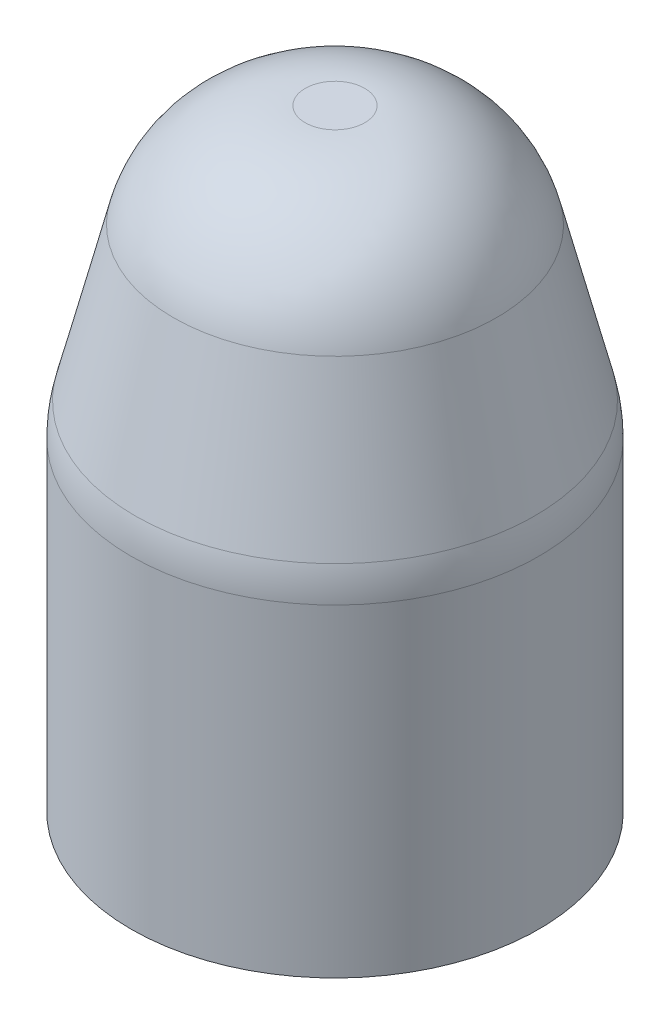
ISO-10303-21;
HEADER;
FILE_DESCRIPTION(('STEP AP214'),'2;1');
FILE_NAME('part.step','',(''),(''),'','','');
FILE_SCHEMA(('AUTOMOTIVE_DESIGN { 1 0 10303 214 1 1 1 1 }'));
ENDSEC;
DATA;
#1=APPLICATION_CONTEXT('core data for automotive mechanical design processes');
#2=APPLICATION_PROTOCOL_DEFINITION('international standard','automotive_design',2000,#1);
#3=PRODUCT_CONTEXT('',#1,'mechanical');
#4=PRODUCT('Part','Part','',(#3));
#5=PRODUCT_RELATED_PRODUCT_CATEGORY('part','',(#4));
#6=PRODUCT_DEFINITION_FORMATION('','',#4);
#7=PRODUCT_DEFINITION_CONTEXT('part definition',#1,'design');
#8=PRODUCT_DEFINITION('design','',#6,#7);
#9=PRODUCT_DEFINITION_SHAPE('','',#8);
#10=(LENGTH_UNIT() NAMED_UNIT(*) SI_UNIT(.MILLI.,.METRE.));
#11=(NAMED_UNIT(*) PLANE_ANGLE_UNIT() SI_UNIT($,.RADIAN.));
#12=(NAMED_UNIT(*) SI_UNIT($,.STERADIAN.) SOLID_ANGLE_UNIT());
#13=UNCERTAINTY_MEASURE_WITH_UNIT(LENGTH_MEASURE(1.E-05),#10,'distance_accuracy_value','');
#14=(GEOMETRIC_REPRESENTATION_CONTEXT(3) GLOBAL_UNCERTAINTY_ASSIGNED_CONTEXT((#13)) GLOBAL_UNIT_ASSIGNED_CONTEXT((#10,
#11,#12)) REPRESENTATION_CONTEXT('',''));
#15=CARTESIAN_POINT('',(0.,0.,0.));
#16=DIRECTION('',(0.,0.,1.));
#17=DIRECTION('',(1.,0.,0.));
#18=AXIS2_PLACEMENT_3D('',#15,#16,#17);
#19=CARTESIAN_POINT('',(0.,9.,0.));
#20=DIRECTION('',(0.,1.,0.));
#21=DIRECTION('',(0.,0.,1.));
#22=AXIS2_PLACEMENT_3D('',#19,#20,#21);
#23=CYLINDRICAL_SURFACE('',#22,3.);
#24=CARTESIAN_POINT('',(0.,4.75378874876468,0.));
#25=DIRECTION('',(0.,-1.,0.));
#26=DIRECTION('',(0.,0.,-1.));
#27=AXIS2_PLACEMENT_3D('',#24,#25,#26);
#28=CIRCLE('',#27,3.);
#29=CARTESIAN_POINT('',(0.,4.75378874876468,-3.));
#30=VERTEX_POINT('',#29);
#31=EDGE_CURVE('E10',#30,#30,#28,.T.);
#32=ORIENTED_EDGE('',*,*,#31,.T.);
#33=EDGE_LOOP('',(#32));
#34=FACE_BOUND('',#33,.T.);
#35=CARTESIAN_POINT('',(0.,0.,0.));
#36=DIRECTION('',(0.,1.,0.));
#37=DIRECTION('',(0.,0.,1.));
#38=AXIS2_PLACEMENT_3D('',#35,#36,#37);
#39=CIRCLE('',#38,3.);
#40=CARTESIAN_POINT('',(0.,0.,3.));
#41=VERTEX_POINT('',#40);
#42=EDGE_CURVE('E53',#41,#41,#39,.T.);
#43=ORIENTED_EDGE('',*,*,#42,.T.);
#44=EDGE_LOOP('',(#43));
#45=FACE_BOUND('',#44,.T.);
#46=ADVANCED_FACE('F33',(#34,#45),#23,.T.);
#47=CARTESIAN_POINT('',(0.,0.,0.));
#48=DIRECTION('',(0.,1.,0.));
#49=DIRECTION('',(0.,0.,1.));
#50=AXIS2_PLACEMENT_3D('',#47,#48,#49);
#51=PLANE('',#50);
#52=ORIENTED_EDGE('',*,*,#42,.F.);
#53=EDGE_LOOP('',(#52));
#54=FACE_BOUND('',#53,.T.);
#55=ADVANCED_FACE('F58',(#54),#51,.F.);
#56=CARTESIAN_POINT('',(0.,9.,0.));
#57=DIRECTION('',(0.,-1.,0.));
#58=DIRECTION('',(0.,0.,-1.));
#59=AXIS2_PLACEMENT_3D('',#56,#57,#58);
#60=PLANE('',#59);
#61=CARTESIAN_POINT('',(0.,9.,0.));
#62=DIRECTION('',(0.,-1.,0.));
#63=DIRECTION('',(0.,0.,-1.));
#64=AXIS2_PLACEMENT_3D('',#61,#62,#63);
#65=CIRCLE('',#64,0.43844718719117);
#66=CARTESIAN_POINT('',(0.,9.,-0.43844718719117));
#67=VERTEX_POINT('',#66);
#68=EDGE_CURVE('E48',#67,#67,#65,.F.);
#69=ORIENTED_EDGE('',*,*,#68,.T.);
#70=EDGE_LOOP('',(#69));
#71=FACE_BOUND('',#70,.T.);
#72=ADVANCED_FACE('F60',(#71),#60,.F.);
#73=CARTESIAN_POINT('',(0.,5.,0.));
#74=DIRECTION('',(0.,-1.,0.));
#75=DIRECTION('',(0.,0.,-1.));
#76=AXIS2_PLACEMENT_3D('',#73,#74,#75);
#77=CONICAL_SURFACE('',#76,3.,0.244978663126864);
#78=CARTESIAN_POINT('',(0.,5.23885999883735,0.));
#79=DIRECTION('',(0.,1.,0.));
#80=DIRECTION('',(0.,0.,1.));
#81=AXIS2_PLACEMENT_3D('',#78,#79,#80);
#82=CIRCLE('',#81,2.94028500029066);
#83=CARTESIAN_POINT('',(0.,5.23885999883735,2.94028500029066));
#84=VERTEX_POINT('',#83);
#85=EDGE_CURVE('E40',#84,#84,#82,.T.);
#86=ORIENTED_EDGE('',*,*,#85,.T.);
#87=EDGE_LOOP('',(#86));
#88=FACE_BOUND('',#87,.T.);
#89=CARTESIAN_POINT('',(0.,7.48507125007267,0.));
#90=DIRECTION('',(0.,1.,0.));
#91=DIRECTION('',(0.,0.,1.));
#92=AXIS2_PLACEMENT_3D('',#89,#90,#91);
#93=CIRCLE('',#92,2.37873218748183);
#94=CARTESIAN_POINT('',(0.,7.48507125007267,2.37873218748183));
#95=VERTEX_POINT('',#94);
#96=EDGE_CURVE('E44',#95,#95,#93,.F.);
#97=ORIENTED_EDGE('',*,*,#96,.T.);
#98=EDGE_LOOP('',(#97));
#99=FACE_BOUND('',#98,.T.);
#100=ADVANCED_FACE('F66',(#88,#99),#77,.T.);
#101=CARTESIAN_POINT('',(0.,7.,0.));
#102=DIRECTION('',(0.,-1.,0.));
#103=DIRECTION('',(0.,0.,-1.));
#104=AXIS2_PLACEMENT_3D('',#101,#102,#103);
#105=DEGENERATE_TOROIDAL_SURFACE('',#104,0.43844718719117,2.,.T.);
#106=ORIENTED_EDGE('',*,*,#96,.F.);
#107=EDGE_LOOP('',(#106));
#108=FACE_BOUND('',#107,.T.);
#109=ORIENTED_EDGE('',*,*,#68,.F.);
#110=EDGE_LOOP('',(#109));
#111=FACE_BOUND('',#110,.T.);
#112=ADVANCED_FACE('F71',(#108,#111),#105,.T.);
#113=CARTESIAN_POINT('',(0.,4.75378874876468,0.));
#114=DIRECTION('',(0.,-1.,0.));
#115=DIRECTION('',(0.,0.,-1.));
#116=AXIS2_PLACEMENT_3D('',#113,#114,#115);
#117=DEGENERATE_TOROIDAL_SURFACE('',#116,1.,2.,.T.);
#118=ORIENTED_EDGE('',*,*,#31,.F.);
#119=EDGE_LOOP('',(#118));
#120=FACE_BOUND('',#119,.T.);
#121=ORIENTED_EDGE('',*,*,#85,.F.);
#122=EDGE_LOOP('',(#121));
#123=FACE_BOUND('',#122,.T.);
#124=ADVANCED_FACE('F35',(#120,#123),#117,.T.);
#125=CLOSED_SHELL('',(#46,#55,#72,#100,#112,#124));
#126=MANIFOLD_SOLID_BREP('B2',#125);
#127=ADVANCED_BREP_SHAPE_REPRESENTATION('',(#18,#126),#14);
#128=SHAPE_DEFINITION_REPRESENTATION(#9,#127);
ENDSEC;
END-ISO-10303-21;
